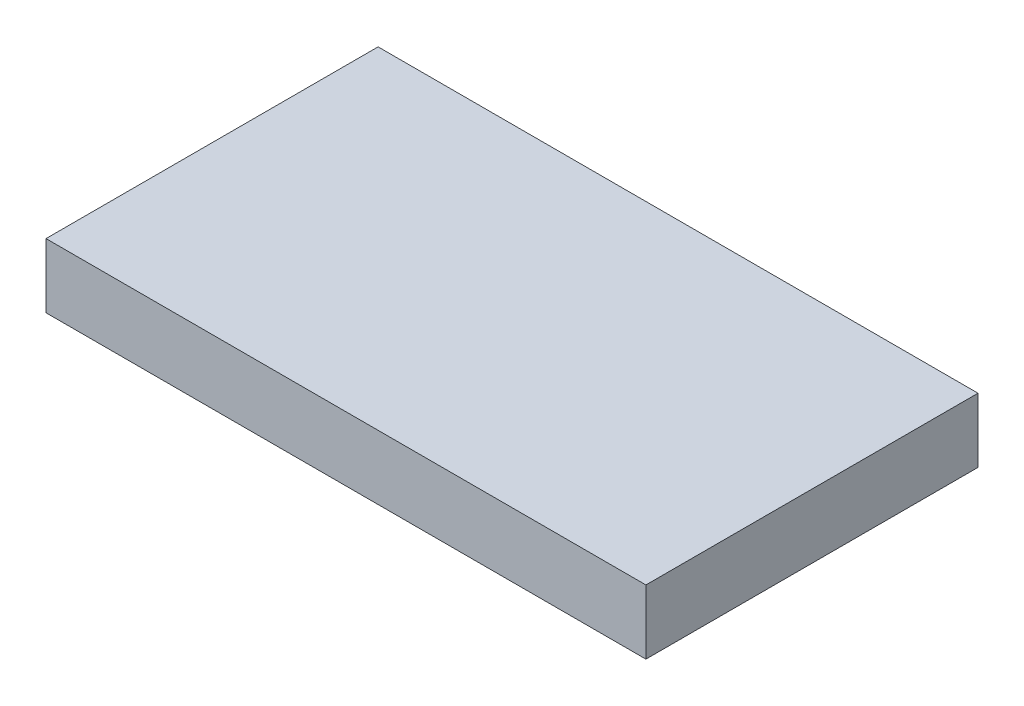
ISO-10303-21;
HEADER;
FILE_DESCRIPTION(('STEP AP214'),'2;1');
FILE_NAME('part.step','',(''),(''),'','','');
FILE_SCHEMA(('AUTOMOTIVE_DESIGN { 1 0 10303 214 1 1 1 1 }'));
ENDSEC;
DATA;
#1=APPLICATION_CONTEXT('core data for automotive mechanical design processes');
#2=APPLICATION_PROTOCOL_DEFINITION('international standard','automotive_design',2000,#1);
#3=PRODUCT_CONTEXT('',#1,'mechanical');
#4=PRODUCT('Part','Part','',(#3));
#5=PRODUCT_RELATED_PRODUCT_CATEGORY('part','',(#4));
#6=PRODUCT_DEFINITION_FORMATION('','',#4);
#7=PRODUCT_DEFINITION_CONTEXT('part definition',#1,'design');
#8=PRODUCT_DEFINITION('design','',#6,#7);
#9=PRODUCT_DEFINITION_SHAPE('','',#8);
#10=(LENGTH_UNIT() NAMED_UNIT(*) SI_UNIT(.MILLI.,.METRE.));
#11=(NAMED_UNIT(*) PLANE_ANGLE_UNIT() SI_UNIT($,.RADIAN.));
#12=(NAMED_UNIT(*) SI_UNIT($,.STERADIAN.) SOLID_ANGLE_UNIT());
#13=UNCERTAINTY_MEASURE_WITH_UNIT(LENGTH_MEASURE(1.E-05),#10,'distance_accuracy_value','');
#14=(GEOMETRIC_REPRESENTATION_CONTEXT(3) GLOBAL_UNCERTAINTY_ASSIGNED_CONTEXT((#13)) GLOBAL_UNIT_ASSIGNED_CONTEXT((#10,
#11,#12)) REPRESENTATION_CONTEXT('',''));
#15=CARTESIAN_POINT('',(0.,0.,0.));
#16=DIRECTION('',(0.,0.,1.));
#17=DIRECTION('',(1.,0.,0.));
#18=AXIS2_PLACEMENT_3D('',#15,#16,#17);
#19=CARTESIAN_POINT('',(0.,6.,0.));
#20=DIRECTION('',(0.,1.,0.));
#21=DIRECTION('',(0.,0.,1.));
#22=AXIS2_PLACEMENT_3D('',#19,#20,#21);
#23=PLANE('',#22);
#24=DIRECTION('',(-1.,0.,0.));
#25=VECTOR('',#24,1.);
#26=CARTESIAN_POINT('',(28.,6.,-15.5));
#27=LINE('',#26,#25);
#28=CARTESIAN_POINT('',(-28.,6.,-15.5));
#29=VERTEX_POINT('',#28);
#30=CARTESIAN_POINT('',(28.,6.,-15.5));
#31=VERTEX_POINT('',#30);
#32=EDGE_CURVE('E68',#29,#31,#27,.F.);
#33=ORIENTED_EDGE('',*,*,#32,.F.);
#34=DIRECTION('',(0.,0.,1.));
#35=VECTOR('',#34,1.);
#36=CARTESIAN_POINT('',(-28.,6.,-15.5));
#37=LINE('',#36,#35);
#38=CARTESIAN_POINT('',(-28.,6.,15.5));
#39=VERTEX_POINT('',#38);
#40=EDGE_CURVE('E20',#39,#29,#37,.F.);
#41=ORIENTED_EDGE('',*,*,#40,.F.);
#42=DIRECTION('',(1.,0.,0.));
#43=VECTOR('',#42,1.);
#44=CARTESIAN_POINT('',(-28.,6.,15.5));
#45=LINE('',#44,#43);
#46=CARTESIAN_POINT('',(28.,6.,15.5));
#47=VERTEX_POINT('',#46);
#48=EDGE_CURVE('E58',#47,#39,#45,.F.);
#49=ORIENTED_EDGE('',*,*,#48,.F.);
#50=DIRECTION('',(0.,0.,-1.));
#51=VECTOR('',#50,1.);
#52=CARTESIAN_POINT('',(28.,6.,15.5));
#53=LINE('',#52,#51);
#54=EDGE_CURVE('E53',#31,#47,#53,.F.);
#55=ORIENTED_EDGE('',*,*,#54,.F.);
#56=EDGE_LOOP('',(#33,#41,#49,#55));
#57=FACE_BOUND('',#56,.T.);
#58=ADVANCED_FACE('F17',(#57),#23,.T.);
#59=CARTESIAN_POINT('',(-28.,0.,-15.5));
#60=DIRECTION('',(-1.,0.,0.));
#61=DIRECTION('',(0.,0.,1.));
#62=AXIS2_PLACEMENT_3D('',#59,#60,#61);
#63=PLANE('',#62);
#64=DIRECTION('',(0.,1.,0.));
#65=VECTOR('',#64,1.);
#66=CARTESIAN_POINT('',(-28.,0.,-15.5));
#67=LINE('',#66,#65);
#68=CARTESIAN_POINT('',(-28.,0.,-15.5));
#69=VERTEX_POINT('',#68);
#70=EDGE_CURVE('E79',#69,#29,#67,.T.);
#71=ORIENTED_EDGE('',*,*,#70,.F.);
#72=DIRECTION('',(0.,0.,1.));
#73=VECTOR('',#72,1.);
#74=CARTESIAN_POINT('',(-28.,0.,0.));
#75=LINE('',#74,#73);
#76=CARTESIAN_POINT('',(-28.,0.,15.5));
#77=VERTEX_POINT('',#76);
#78=EDGE_CURVE('E74',#69,#77,#75,.T.);
#79=ORIENTED_EDGE('',*,*,#78,.T.);
#80=DIRECTION('',(0.,1.,0.));
#81=VECTOR('',#80,1.);
#82=CARTESIAN_POINT('',(-28.,0.,15.5));
#83=LINE('',#82,#81);
#84=EDGE_CURVE('E63',#39,#77,#83,.F.);
#85=ORIENTED_EDGE('',*,*,#84,.F.);
#86=ORIENTED_EDGE('',*,*,#40,.T.);
#87=EDGE_LOOP('',(#71,#79,#85,#86));
#88=FACE_BOUND('',#87,.T.);
#89=ADVANCED_FACE('F73',(#88),#63,.T.);
#90=CARTESIAN_POINT('',(-28.,0.,15.5));
#91=DIRECTION('',(0.,0.,1.));
#92=DIRECTION('',(1.,0.,0.));
#93=AXIS2_PLACEMENT_3D('',#90,#91,#92);
#94=PLANE('',#93);
#95=ORIENTED_EDGE('',*,*,#84,.T.);
#96=DIRECTION('',(1.,0.,0.));
#97=VECTOR('',#96,1.);
#98=CARTESIAN_POINT('',(0.,0.,15.5));
#99=LINE('',#98,#97);
#100=CARTESIAN_POINT('',(28.,0.,15.5));
#101=VERTEX_POINT('',#100);
#102=EDGE_CURVE('E84',#77,#101,#99,.T.);
#103=ORIENTED_EDGE('',*,*,#102,.T.);
#104=DIRECTION('',(0.,1.,0.));
#105=VECTOR('',#104,1.);
#106=CARTESIAN_POINT('',(28.,0.,15.5));
#107=LINE('',#106,#105);
#108=EDGE_CURVE('E65',#47,#101,#107,.F.);
#109=ORIENTED_EDGE('',*,*,#108,.F.);
#110=ORIENTED_EDGE('',*,*,#48,.T.);
#111=EDGE_LOOP('',(#95,#103,#109,#110));
#112=FACE_BOUND('',#111,.T.);
#113=ADVANCED_FACE('F60',(#112),#94,.T.);
#114=CARTESIAN_POINT('',(28.,0.,15.5));
#115=DIRECTION('',(1.,0.,0.));
#116=DIRECTION('',(0.,0.,-1.));
#117=AXIS2_PLACEMENT_3D('',#114,#115,#116);
#118=PLANE('',#117);
#119=ORIENTED_EDGE('',*,*,#108,.T.);
#120=DIRECTION('',(0.,0.,1.));
#121=VECTOR('',#120,1.);
#122=CARTESIAN_POINT('',(28.,0.,0.));
#123=LINE('',#122,#121);
#124=CARTESIAN_POINT('',(28.,0.,-15.5));
#125=VERTEX_POINT('',#124);
#126=EDGE_CURVE('E26',#101,#125,#123,.F.);
#127=ORIENTED_EDGE('',*,*,#126,.T.);
#128=DIRECTION('',(0.,1.,0.));
#129=VECTOR('',#128,1.);
#130=CARTESIAN_POINT('',(28.,0.,-15.5));
#131=LINE('',#130,#129);
#132=EDGE_CURVE('E34',#31,#125,#131,.F.);
#133=ORIENTED_EDGE('',*,*,#132,.F.);
#134=ORIENTED_EDGE('',*,*,#54,.T.);
#135=EDGE_LOOP('',(#119,#127,#133,#134));
#136=FACE_BOUND('',#135,.T.);
#137=ADVANCED_FACE('F88',(#136),#118,.T.);
#138=CARTESIAN_POINT('',(28.,0.,-15.5));
#139=DIRECTION('',(0.,0.,-1.));
#140=DIRECTION('',(-1.,0.,0.));
#141=AXIS2_PLACEMENT_3D('',#138,#139,#140);
#142=PLANE('',#141);
#143=ORIENTED_EDGE('',*,*,#132,.T.);
#144=DIRECTION('',(1.,0.,0.));
#145=VECTOR('',#144,1.);
#146=CARTESIAN_POINT('',(0.,0.,-15.5));
#147=LINE('',#146,#145);
#148=EDGE_CURVE('E11',#125,#69,#147,.F.);
#149=ORIENTED_EDGE('',*,*,#148,.T.);
#150=ORIENTED_EDGE('',*,*,#70,.T.);
#151=ORIENTED_EDGE('',*,*,#32,.T.);
#152=EDGE_LOOP('',(#143,#149,#150,#151));
#153=FACE_BOUND('',#152,.T.);
#154=ADVANCED_FACE('F91',(#153),#142,.T.);
#155=CARTESIAN_POINT('',(0.,0.,0.));
#156=DIRECTION('',(0.,1.,0.));
#157=DIRECTION('',(0.,0.,1.));
#158=AXIS2_PLACEMENT_3D('',#155,#156,#157);
#159=PLANE('',#158);
#160=ORIENTED_EDGE('',*,*,#126,.F.);
#161=ORIENTED_EDGE('',*,*,#102,.F.);
#162=ORIENTED_EDGE('',*,*,#78,.F.);
#163=ORIENTED_EDGE('',*,*,#148,.F.);
#164=EDGE_LOOP('',(#160,#161,#162,#163));
#165=FACE_BOUND('',#164,.T.);
#166=ADVANCED_FACE('F90',(#165),#159,.F.);
#167=CLOSED_SHELL('',(#58,#89,#113,#137,#154,#166));
#168=MANIFOLD_SOLID_BREP('B1',#167);
#169=ADVANCED_BREP_SHAPE_REPRESENTATION('',(#18,#168),#14);
#170=SHAPE_DEFINITION_REPRESENTATION(#9,#169);
ENDSEC;
END-ISO-10303-21;
